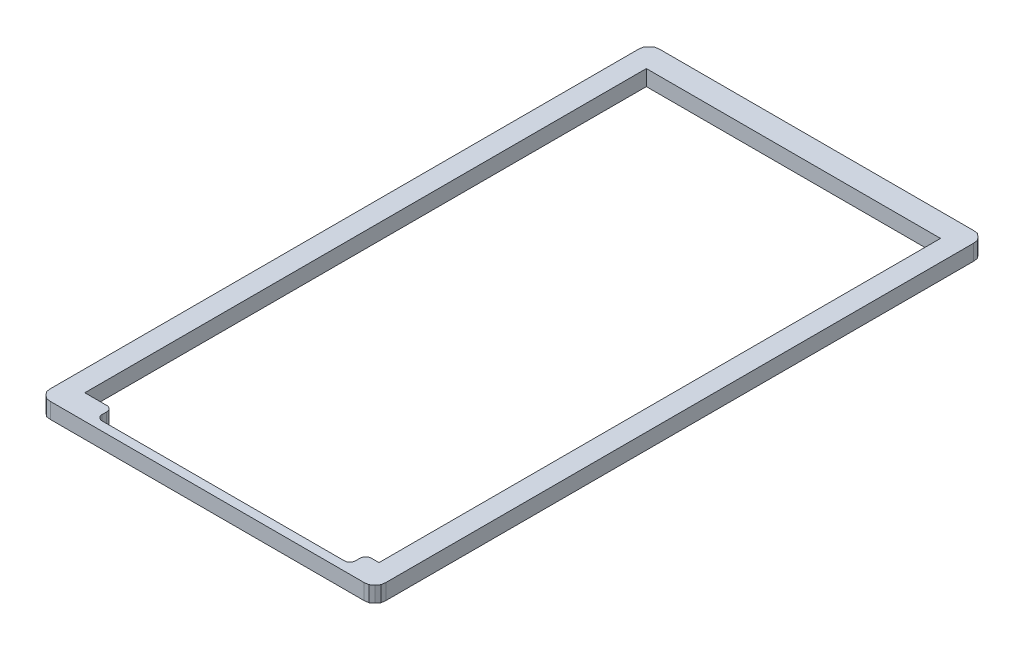
ISO-10303-21;
HEADER;
FILE_DESCRIPTION(('STEP AP214'),'2;1');
FILE_NAME('part.step','',(''),(''),'','','');
FILE_SCHEMA(('AUTOMOTIVE_DESIGN { 1 0 10303 214 1 1 1 1 }'));
ENDSEC;
DATA;
#1=APPLICATION_CONTEXT('core data for automotive mechanical design processes');
#2=APPLICATION_PROTOCOL_DEFINITION('international standard','automotive_design',2000,#1);
#3=PRODUCT_CONTEXT('',#1,'mechanical');
#4=PRODUCT('Part','Part','',(#3));
#5=PRODUCT_RELATED_PRODUCT_CATEGORY('part','',(#4));
#6=PRODUCT_DEFINITION_FORMATION('','',#4);
#7=PRODUCT_DEFINITION_CONTEXT('part definition',#1,'design');
#8=PRODUCT_DEFINITION('design','',#6,#7);
#9=PRODUCT_DEFINITION_SHAPE('','',#8);
#10=(LENGTH_UNIT() NAMED_UNIT(*) SI_UNIT(.MILLI.,.METRE.));
#11=(NAMED_UNIT(*) PLANE_ANGLE_UNIT() SI_UNIT($,.RADIAN.));
#12=(NAMED_UNIT(*) SI_UNIT($,.STERADIAN.) SOLID_ANGLE_UNIT());
#13=UNCERTAINTY_MEASURE_WITH_UNIT(LENGTH_MEASURE(1.E-05),#10,'distance_accuracy_value','');
#14=(GEOMETRIC_REPRESENTATION_CONTEXT(3) GLOBAL_UNCERTAINTY_ASSIGNED_CONTEXT((#13)) GLOBAL_UNIT_ASSIGNED_CONTEXT((#10,
#11,#12)) REPRESENTATION_CONTEXT('',''));
#15=CARTESIAN_POINT('',(0.,0.,0.));
#16=DIRECTION('',(0.,0.,1.));
#17=DIRECTION('',(1.,0.,0.));
#18=AXIS2_PLACEMENT_3D('',#15,#16,#17);
#19=CARTESIAN_POINT('',(14.4096306575184,63.9110415714486,-25.2102864699325));
#20=DIRECTION('',(-0.123874595080871,0.,0.992297881028449));
#21=DIRECTION('',(0.992297881028449,0.,0.123874595080871));
#22=AXIS2_PLACEMENT_3D('',#19,#20,#21);
#23=PLANE('',#22);
#24=DIRECTION('',(-0.992297881028449,0.,-0.123874595080871));
#25=VECTOR('',#24,1.);
#26=CARTESIAN_POINT('',(14.4096306575184,1.4,-25.2102864699325));
#27=LINE('',#26,#25);
#28=CARTESIAN_POINT('',(14.4096306575184,1.4,-25.2102864699325));
#29=VERTEX_POINT('',#28);
#30=CARTESIAN_POINT('',(14.016111453808,1.4,-25.2594118716371));
#31=VERTEX_POINT('',#30);
#32=EDGE_CURVE('E563',#29,#31,#27,.T.);
#33=ORIENTED_EDGE('',*,*,#32,.F.);
#34=DIRECTION('',(0.,-1.,0.));
#35=VECTOR('',#34,1.);
#36=CARTESIAN_POINT('',(14.4096306575184,63.9110415714486,-25.2102864699325));
#37=LINE('',#36,#35);
#38=CARTESIAN_POINT('',(14.4096306575184,0.,-25.2102864699325));
#39=VERTEX_POINT('',#38);
#40=EDGE_CURVE('E51',#29,#39,#37,.T.);
#41=ORIENTED_EDGE('',*,*,#40,.T.);
#42=DIRECTION('',(-0.992297881028449,0.,-0.123874595080871));
#43=VECTOR('',#42,1.);
#44=CARTESIAN_POINT('',(14.4096306575184,0.,-25.2102864699325));
#45=LINE('',#44,#43);
#46=CARTESIAN_POINT('',(14.016111453808,0.,-25.2594118716371));
#47=VERTEX_POINT('',#46);
#48=EDGE_CURVE('E342',#39,#47,#45,.T.);
#49=ORIENTED_EDGE('',*,*,#48,.T.);
#50=DIRECTION('',(0.,-1.,0.));
#51=VECTOR('',#50,1.);
#52=CARTESIAN_POINT('',(14.016111453808,63.9110415714486,-25.2594118716371));
#53=LINE('',#52,#51);
#54=EDGE_CURVE('E345',#31,#47,#53,.T.);
#55=ORIENTED_EDGE('',*,*,#54,.F.);
#56=EDGE_LOOP('',(#33,#41,#49,#55));
#57=FACE_BOUND('',#56,.T.);
#58=ADVANCED_FACE('F36',(#57),#23,.F.);
#59=CARTESIAN_POINT('',(14.7042744638658,63.9110415714486,-24.9645751018185));
#60=DIRECTION('',(-0.640453348110969,0.,0.76799707609694));
#61=DIRECTION('',(0.76799707609694,0.,0.64045334811097));
#62=AXIS2_PLACEMENT_3D('',#59,#60,#61);
#63=PLANE('',#62);
#64=DIRECTION('',(-0.76799707609694,0.,-0.64045334811097));
#65=VECTOR('',#64,1.);
#66=CARTESIAN_POINT('',(14.7042744638658,1.4,-24.9645751018185));
#67=LINE('',#66,#65);
#68=CARTESIAN_POINT('',(14.7042744638658,1.4,-24.9645751018185));
#69=VERTEX_POINT('',#68);
#70=EDGE_CURVE('E407',#69,#29,#67,.T.);
#71=ORIENTED_EDGE('',*,*,#70,.F.);
#72=DIRECTION('',(0.,-1.,0.));
#73=VECTOR('',#72,1.);
#74=CARTESIAN_POINT('',(14.7042744638658,63.9110415714486,-24.9645751018185));
#75=LINE('',#74,#73);
#76=CARTESIAN_POINT('',(14.7042744638658,0.,-24.9645751018185));
#77=VERTEX_POINT('',#76);
#78=EDGE_CURVE('E348',#69,#77,#75,.T.);
#79=ORIENTED_EDGE('',*,*,#78,.T.);
#80=DIRECTION('',(-0.76799707609694,0.,-0.64045334811097));
#81=VECTOR('',#80,1.);
#82=CARTESIAN_POINT('',(14.7042744638658,0.,-24.9645751018185));
#83=LINE('',#82,#81);
#84=EDGE_CURVE('E340',#77,#39,#83,.T.);
#85=ORIENTED_EDGE('',*,*,#84,.T.);
#86=ORIENTED_EDGE('',*,*,#40,.F.);
#87=EDGE_LOOP('',(#71,#79,#85,#86));
#88=FACE_BOUND('',#87,.T.);
#89=ADVANCED_FACE('F404',(#88),#63,.F.);
#90=CARTESIAN_POINT('',(14.950603089641,63.9110415714486,-24.6697164609948));
#91=DIRECTION('',(-0.767435927377188,0.,0.641125648660788));
#92=DIRECTION('',(0.641125648660788,0.,0.767435927377188));
#93=AXIS2_PLACEMENT_3D('',#90,#91,#92);
#94=PLANE('',#93);
#95=DIRECTION('',(-0.641125648660788,0.,-0.767435927377188));
#96=VECTOR('',#95,1.);
#97=CARTESIAN_POINT('',(14.950603089641,1.4,-24.6697164609948));
#98=LINE('',#97,#96);
#99=CARTESIAN_POINT('',(14.950603089641,1.4,-24.6697164609948));
#100=VERTEX_POINT('',#99);
#101=EDGE_CURVE('E412',#100,#69,#98,.T.);
#102=ORIENTED_EDGE('',*,*,#101,.F.);
#103=DIRECTION('',(0.,-1.,0.));
#104=VECTOR('',#103,1.);
#105=CARTESIAN_POINT('',(14.950603089641,63.9110415714486,-24.6697164609948));
#106=LINE('',#105,#104);
#107=CARTESIAN_POINT('',(14.950603089641,0.,-24.6697164609948));
#108=VERTEX_POINT('',#107);
#109=EDGE_CURVE('E350',#100,#108,#106,.T.);
#110=ORIENTED_EDGE('',*,*,#109,.T.);
#111=DIRECTION('',(-0.641125648660788,0.,-0.767435927377187));
#112=VECTOR('',#111,1.);
#113=CARTESIAN_POINT('',(14.950603089641,0.,-24.6697164609948));
#114=LINE('',#113,#112);
#115=EDGE_CURVE('E337',#108,#77,#114,.T.);
#116=ORIENTED_EDGE('',*,*,#115,.T.);
#117=ORIENTED_EDGE('',*,*,#78,.F.);
#118=EDGE_LOOP('',(#102,#110,#116,#117));
#119=FACE_BOUND('',#118,.T.);
#120=ADVANCED_FACE('F410',(#119),#94,.F.);
#121=CARTESIAN_POINT('',(14.9997812646371,63.9110415714486,-24.2766132656204));
#122=DIRECTION('',(-0.992265359293344,0.,0.124134832929561));
#123=DIRECTION('',(0.124134832929561,0.,0.992265359293344));
#124=AXIS2_PLACEMENT_3D('',#121,#122,#123);
#125=PLANE('',#124);
#126=DIRECTION('',(-0.124134832929561,0.,-0.992265359293344));
#127=VECTOR('',#126,1.);
#128=CARTESIAN_POINT('',(14.9997812646371,1.4,-24.2766132656204));
#129=LINE('',#128,#127);
#130=CARTESIAN_POINT('',(14.9997812646371,1.4,-24.2766132656204));
#131=VERTEX_POINT('',#130);
#132=EDGE_CURVE('E567',#131,#100,#129,.T.);
#133=ORIENTED_EDGE('',*,*,#132,.F.);
#134=DIRECTION('',(0.,-1.,0.));
#135=VECTOR('',#134,1.);
#136=CARTESIAN_POINT('',(14.9997812646371,63.9110415714486,-24.2766132656204));
#137=LINE('',#136,#135);
#138=CARTESIAN_POINT('',(14.9997812646371,0.,-24.2766132656204));
#139=VERTEX_POINT('',#138);
#140=EDGE_CURVE('E352',#131,#139,#137,.T.);
#141=ORIENTED_EDGE('',*,*,#140,.T.);
#142=DIRECTION('',(-0.124134832929561,0.,-0.992265359293344));
#143=VECTOR('',#142,1.);
#144=CARTESIAN_POINT('',(14.9997812646371,0.,-24.2766132656204));
#145=LINE('',#144,#143);
#146=EDGE_CURVE('E334',#139,#108,#145,.T.);
#147=ORIENTED_EDGE('',*,*,#146,.T.);
#148=ORIENTED_EDGE('',*,*,#109,.F.);
#149=EDGE_LOOP('',(#133,#141,#147,#148));
#150=FACE_BOUND('',#149,.T.);
#151=ADVANCED_FACE('F415',(#150),#125,.F.);
#152=CARTESIAN_POINT('',(14.9997124752265,63.9110415714486,28.2573158339782));
#153=DIRECTION('',(-0.999999999999143,0.,-1.30942824550507E-06));
#154=DIRECTION('',(-1.30942824550507E-06,0.,0.999999999999143));
#155=AXIS2_PLACEMENT_3D('',#152,#153,#154);
#156=PLANE('',#155);
#157=DIRECTION('',(1.30942824550507E-06,0.,-0.999999999999143));
#158=VECTOR('',#157,1.);
#159=CARTESIAN_POINT('',(14.9997124752265,1.4,28.2573158339782));
#160=LINE('',#159,#158);
#161=CARTESIAN_POINT('',(14.9997124752265,1.4,28.2573158339782));
#162=VERTEX_POINT('',#161);
#163=EDGE_CURVE('E424',#162,#131,#160,.T.);
#164=ORIENTED_EDGE('',*,*,#163,.F.);
#165=DIRECTION('',(0.,-1.,0.));
#166=VECTOR('',#165,1.);
#167=CARTESIAN_POINT('',(14.9997124752265,63.9110415714486,28.2573158339782));
#168=LINE('',#167,#166);
#169=CARTESIAN_POINT('',(14.9997124752265,0.,28.2573158339782));
#170=VERTEX_POINT('',#169);
#171=EDGE_CURVE('E354',#162,#170,#168,.T.);
#172=ORIENTED_EDGE('',*,*,#171,.T.);
#173=DIRECTION('',(1.30942824550507E-06,0.,-0.999999999999143));
#174=VECTOR('',#173,1.);
#175=CARTESIAN_POINT('',(14.9997124752265,0.,28.2573158339782));
#176=LINE('',#175,#174);
#177=EDGE_CURVE('E331',#170,#139,#176,.T.);
#178=ORIENTED_EDGE('',*,*,#177,.T.);
#179=ORIENTED_EDGE('',*,*,#140,.F.);
#180=EDGE_LOOP('',(#164,#172,#178,#179));
#181=FACE_BOUND('',#180,.T.);
#182=ADVANCED_FACE('F421',(#181),#156,.F.);
#183=CARTESIAN_POINT('',(14.9504655108198,63.9110415714486,28.6505377576656));
#184=DIRECTION('',(-0.992248585974181,0.,-0.124268836126516));
#185=DIRECTION('',(-0.124268836126516,0.,0.992248585974181));
#186=AXIS2_PLACEMENT_3D('',#183,#184,#185);
#187=PLANE('',#186);
#188=DIRECTION('',(0.124268836126516,0.,-0.992248585974181));
#189=VECTOR('',#188,1.);
#190=CARTESIAN_POINT('',(14.9504655108198,1.4,28.6505377576656));
#191=LINE('',#190,#189);
#192=CARTESIAN_POINT('',(14.9504655108198,1.4,28.6505377576656));
#193=VERTEX_POINT('',#192);
#194=EDGE_CURVE('E429',#193,#162,#191,.T.);
#195=ORIENTED_EDGE('',*,*,#194,.F.);
#196=DIRECTION('',(0.,-1.,0.));
#197=VECTOR('',#196,1.);
#198=CARTESIAN_POINT('',(14.9504655108198,63.9110415714486,28.6505377576656));
#199=LINE('',#198,#197);
#200=CARTESIAN_POINT('',(14.9504655108198,0.,28.6505377576656));
#201=VERTEX_POINT('',#200);
#202=EDGE_CURVE('E356',#193,#201,#199,.T.);
#203=ORIENTED_EDGE('',*,*,#202,.T.);
#204=DIRECTION('',(0.124268836126516,0.,-0.992248585974181));
#205=VECTOR('',#204,1.);
#206=CARTESIAN_POINT('',(14.9504655108198,0.,28.6505377576656));
#207=LINE('',#206,#205);
#208=EDGE_CURVE('E328',#201,#170,#207,.T.);
#209=ORIENTED_EDGE('',*,*,#208,.T.);
#210=ORIENTED_EDGE('',*,*,#171,.F.);
#211=EDGE_LOOP('',(#195,#203,#209,#210));
#212=FACE_BOUND('',#211,.T.);
#213=ADVANCED_FACE('F427',(#212),#187,.F.);
#214=CARTESIAN_POINT('',(14.7045621286737,63.9110415714486,28.9453963984893));
#215=DIRECTION('',(-0.767980603694604,0.,-0.640473100410057));
#216=DIRECTION('',(-0.640473100410057,0.,0.767980603694604));
#217=AXIS2_PLACEMENT_3D('',#214,#215,#216);
#218=PLANE('',#217);
#219=DIRECTION('',(0.640473100410057,0.,-0.767980603694604));
#220=VECTOR('',#219,1.);
#221=CARTESIAN_POINT('',(14.7045621286737,1.4,28.9453963984893));
#222=LINE('',#221,#220);
#223=CARTESIAN_POINT('',(14.7045621286737,1.4,28.9453963984893));
#224=VERTEX_POINT('',#223);
#225=EDGE_CURVE('E571',#224,#193,#222,.T.);
#226=ORIENTED_EDGE('',*,*,#225,.F.);
#227=DIRECTION('',(0.,-1.,0.));
#228=VECTOR('',#227,1.);
#229=CARTESIAN_POINT('',(14.7045621286737,63.9110415714486,28.9453963984893));
#230=LINE('',#229,#228);
#231=CARTESIAN_POINT('',(14.7045621286737,0.,28.9453963984893));
#232=VERTEX_POINT('',#231);
#233=EDGE_CURVE('E358',#224,#232,#230,.T.);
#234=ORIENTED_EDGE('',*,*,#233,.T.);
#235=DIRECTION('',(0.640473100410057,0.,-0.767980603694604));
#236=VECTOR('',#235,1.);
#237=CARTESIAN_POINT('',(14.7045621286737,0.,28.9453963984893));
#238=LINE('',#237,#236);
#239=EDGE_CURVE('E325',#232,#201,#238,.T.);
#240=ORIENTED_EDGE('',*,*,#239,.T.);
#241=ORIENTED_EDGE('',*,*,#202,.F.);
#242=EDGE_LOOP('',(#226,#234,#240,#241));
#243=FACE_BOUND('',#242,.T.);
#244=ADVANCED_FACE('F432',(#243),#218,.F.);
#245=CARTESIAN_POINT('',(14.4094805715316,63.9110415714486,29.1911140154618));
#246=DIRECTION('',(-0.639902054883014,0.,-0.768456479025648));
#247=DIRECTION('',(-0.768456479025648,0.,0.639902054883014));
#248=AXIS2_PLACEMENT_3D('',#245,#246,#247);
#249=PLANE('',#248);
#250=DIRECTION('',(0.768456479025648,0.,-0.639902054883014));
#251=VECTOR('',#250,1.);
#252=CARTESIAN_POINT('',(14.4094805715316,1.4,29.1911140154618));
#253=LINE('',#252,#251);
#254=CARTESIAN_POINT('',(14.4094805715316,1.4,29.1911140154618));
#255=VERTEX_POINT('',#254);
#256=EDGE_CURVE('E441',#255,#224,#253,.T.);
#257=ORIENTED_EDGE('',*,*,#256,.F.);
#258=DIRECTION('',(0.,-1.,0.));
#259=VECTOR('',#258,1.);
#260=CARTESIAN_POINT('',(14.4094805715316,63.9110415714486,29.1911140154618));
#261=LINE('',#260,#259);
#262=CARTESIAN_POINT('',(14.4094805715316,0.,29.1911140154618));
#263=VERTEX_POINT('',#262);
#264=EDGE_CURVE('E360',#255,#263,#261,.T.);
#265=ORIENTED_EDGE('',*,*,#264,.T.);
#266=DIRECTION('',(0.768456479025648,0.,-0.639902054883014));
#267=VECTOR('',#266,1.);
#268=CARTESIAN_POINT('',(14.4094805715316,0.,29.1911140154618));
#269=LINE('',#268,#267);
#270=EDGE_CURVE('E322',#263,#232,#269,.T.);
#271=ORIENTED_EDGE('',*,*,#270,.T.);
#272=ORIENTED_EDGE('',*,*,#233,.F.);
#273=EDGE_LOOP('',(#257,#265,#271,#272));
#274=FACE_BOUND('',#273,.T.);
#275=ADVANCED_FACE('F438',(#274),#249,.F.);
#276=CARTESIAN_POINT('',(14.0159426070729,63.9110415714486,29.2402550393129));
#277=DIRECTION('',(-0.123907566611649,0.,-0.992293764434897));
#278=DIRECTION('',(-0.992293764434897,0.,0.123907566611649));
#279=AXIS2_PLACEMENT_3D('',#276,#277,#278);
#280=PLANE('',#279);
#281=DIRECTION('',(0.992293764434897,0.,-0.123907566611649));
#282=VECTOR('',#281,1.);
#283=CARTESIAN_POINT('',(14.0159426070729,1.4,29.2402550393129));
#284=LINE('',#283,#282);
#285=CARTESIAN_POINT('',(14.0159426070729,1.4,29.2402550393129));
#286=VERTEX_POINT('',#285);
#287=EDGE_CURVE('E446',#286,#255,#284,.T.);
#288=ORIENTED_EDGE('',*,*,#287,.F.);
#289=DIRECTION('',(0.,-1.,0.));
#290=VECTOR('',#289,1.);
#291=CARTESIAN_POINT('',(14.0159426070729,63.9110415714486,29.2402550393129));
#292=LINE('',#291,#290);
#293=CARTESIAN_POINT('',(14.0159426070729,0.,29.2402550393129));
#294=VERTEX_POINT('',#293);
#295=EDGE_CURVE('E362',#286,#294,#292,.T.);
#296=ORIENTED_EDGE('',*,*,#295,.T.);
#297=DIRECTION('',(0.992293764434897,0.,-0.123907566611649));
#298=VECTOR('',#297,1.);
#299=CARTESIAN_POINT('',(14.0159426070729,0.,29.2402550393129));
#300=LINE('',#299,#298);
#301=EDGE_CURVE('E319',#294,#263,#300,.T.);
#302=ORIENTED_EDGE('',*,*,#301,.T.);
#303=ORIENTED_EDGE('',*,*,#264,.F.);
#304=EDGE_LOOP('',(#288,#296,#302,#303));
#305=FACE_BOUND('',#304,.T.);
#306=ADVANCED_FACE('F444',(#305),#280,.F.);
#307=CARTESIAN_POINT('',(-14.0169491538318,63.9110415714486,29.2401738041514));
#308=DIRECTION('',(2.8978516447548E-06,0.,-0.999999999995801));
#309=DIRECTION('',(-0.999999999995801,0.,-2.8978516447548E-06));
#310=AXIS2_PLACEMENT_3D('',#307,#308,#309);
#311=PLANE('',#310);
#312=DIRECTION('',(0.999999999995801,0.,2.8978516447548E-06));
#313=VECTOR('',#312,1.);
#314=CARTESIAN_POINT('',(-14.0169491538318,1.4,29.2401738041514));
#315=LINE('',#314,#313);
#316=CARTESIAN_POINT('',(-14.0169491538318,1.4,29.2401738041514));
#317=VERTEX_POINT('',#316);
#318=EDGE_CURVE('E575',#317,#286,#315,.T.);
#319=ORIENTED_EDGE('',*,*,#318,.F.);
#320=DIRECTION('',(0.,-1.,0.));
#321=VECTOR('',#320,1.);
#322=CARTESIAN_POINT('',(-14.0169491538318,63.9110415714486,29.2401738041514));
#323=LINE('',#322,#321);
#324=CARTESIAN_POINT('',(-14.0169491538318,0.,29.2401738041514));
#325=VERTEX_POINT('',#324);
#326=EDGE_CURVE('E364',#317,#325,#323,.T.);
#327=ORIENTED_EDGE('',*,*,#326,.T.);
#328=DIRECTION('',(0.999999999995801,0.,2.8978516447548E-06));
#329=VECTOR('',#328,1.);
#330=CARTESIAN_POINT('',(-14.0169491538318,0.,29.2401738041514));
#331=LINE('',#330,#329);
#332=EDGE_CURVE('E316',#325,#294,#331,.T.);
#333=ORIENTED_EDGE('',*,*,#332,.T.);
#334=ORIENTED_EDGE('',*,*,#295,.F.);
#335=EDGE_LOOP('',(#319,#327,#333,#334));
#336=FACE_BOUND('',#335,.T.);
#337=ADVANCED_FACE('F449',(#336),#311,.F.);
#338=CARTESIAN_POINT('',(-14.4100556210787,63.9110415714486,29.1909515451389));
#339=DIRECTION('',(0.124243374046642,0.,-0.992251774503581));
#340=DIRECTION('',(-0.992251774503581,0.,-0.124243374046642));
#341=AXIS2_PLACEMENT_3D('',#338,#339,#340);
#342=PLANE('',#341);
#343=DIRECTION('',(0.992251774503581,0.,0.124243374046642));
#344=VECTOR('',#343,1.);
#345=CARTESIAN_POINT('',(-14.4100556210787,1.4,29.1909515451389));
#346=LINE('',#345,#344);
#347=CARTESIAN_POINT('',(-14.4100556210787,1.4,29.1909515451389));
#348=VERTEX_POINT('',#347);
#349=EDGE_CURVE('E458',#348,#317,#346,.T.);
#350=ORIENTED_EDGE('',*,*,#349,.F.);
#351=DIRECTION('',(0.,-1.,0.));
#352=VECTOR('',#351,1.);
#353=CARTESIAN_POINT('',(-14.4100556210787,63.9110415714486,29.1909515451389));
#354=LINE('',#353,#352);
#355=CARTESIAN_POINT('',(-14.4100556210787,0.,29.1909515451389));
#356=VERTEX_POINT('',#355);
#357=EDGE_CURVE('E366',#348,#356,#354,.T.);
#358=ORIENTED_EDGE('',*,*,#357,.T.);
#359=DIRECTION('',(0.992251774503581,0.,0.124243374046642));
#360=VECTOR('',#359,1.);
#361=CARTESIAN_POINT('',(-14.4100556210787,0.,29.1909515451389));
#362=LINE('',#361,#360);
#363=EDGE_CURVE('E313',#356,#325,#362,.T.);
#364=ORIENTED_EDGE('',*,*,#363,.T.);
#365=ORIENTED_EDGE('',*,*,#326,.F.);
#366=EDGE_LOOP('',(#350,#358,#364,#365));
#367=FACE_BOUND('',#366,.T.);
#368=ADVANCED_FACE('F455',(#367),#342,.F.);
#369=CARTESIAN_POINT('',(-14.7051371782208,63.9110415714486,28.9456463528323));
#370=DIRECTION('',(0.639267150755278,0.,-0.768984726743795));
#371=DIRECTION('',(-0.768984726743795,0.,-0.639267150755278));
#372=AXIS2_PLACEMENT_3D('',#369,#370,#371);
#373=PLANE('',#372);
#374=DIRECTION('',(0.768984726743795,0.,0.639267150755278));
#375=VECTOR('',#374,1.);
#376=CARTESIAN_POINT('',(-14.7051371782208,1.4,28.9456463528323));
#377=LINE('',#376,#375);
#378=CARTESIAN_POINT('',(-14.7051371782208,1.4,28.9456463528323));
#379=VERTEX_POINT('',#378);
#380=EDGE_CURVE('E463',#379,#348,#377,.T.);
#381=ORIENTED_EDGE('',*,*,#380,.F.);
#382=DIRECTION('',(0.,-1.,0.));
#383=VECTOR('',#382,1.);
#384=CARTESIAN_POINT('',(-14.7051371782208,63.9110415714486,28.9456463528323));
#385=LINE('',#384,#383);
#386=CARTESIAN_POINT('',(-14.7051371782208,0.,28.9456463528323));
#387=VERTEX_POINT('',#386);
#388=EDGE_CURVE('E368',#379,#387,#385,.T.);
#389=ORIENTED_EDGE('',*,*,#388,.T.);
#390=DIRECTION('',(0.768984726743795,0.,0.639267150755278));
#391=VECTOR('',#390,1.);
#392=CARTESIAN_POINT('',(-14.7051371782208,0.,28.9456463528323));
#393=LINE('',#392,#391);
#394=EDGE_CURVE('E310',#387,#356,#393,.T.);
#395=ORIENTED_EDGE('',*,*,#394,.T.);
#396=ORIENTED_EDGE('',*,*,#357,.F.);
#397=EDGE_LOOP('',(#381,#389,#395,#396));
#398=FACE_BOUND('',#397,.T.);
#399=ADVANCED_FACE('F461',(#398),#373,.F.);
#400=CARTESIAN_POINT('',(-14.9510405603669,63.9110415714486,28.6503752873426));
#401=DIRECTION('',(0.768420697805103,0.,-0.63994502200167));
#402=DIRECTION('',(-0.63994502200167,0.,-0.768420697805103));
#403=AXIS2_PLACEMENT_3D('',#400,#401,#402);
#404=PLANE('',#403);
#405=DIRECTION('',(0.63994502200167,0.,0.768420697805103));
#406=VECTOR('',#405,1.);
#407=CARTESIAN_POINT('',(-14.9510405603669,1.4,28.6503752873426));
#408=LINE('',#407,#406);
#409=CARTESIAN_POINT('',(-14.9510405603669,1.4,28.6503752873426));
#410=VERTEX_POINT('',#409);
#411=EDGE_CURVE('E579',#410,#379,#408,.T.);
#412=ORIENTED_EDGE('',*,*,#411,.F.);
#413=DIRECTION('',(0.,-1.,0.));
#414=VECTOR('',#413,1.);
#415=CARTESIAN_POINT('',(-14.9510405603669,63.9110415714486,28.6503752873426));
#416=LINE('',#415,#414);
#417=CARTESIAN_POINT('',(-14.9510405603669,0.,28.6503752873426));
#418=VERTEX_POINT('',#417);
#419=EDGE_CURVE('E370',#410,#418,#416,.T.);
#420=ORIENTED_EDGE('',*,*,#419,.T.);
#421=DIRECTION('',(0.63994502200167,0.,0.768420697805103));
#422=VECTOR('',#421,1.);
#423=CARTESIAN_POINT('',(-14.9510405603669,0.,28.6503752873426));
#424=LINE('',#423,#422);
#425=EDGE_CURVE('E307',#418,#387,#424,.T.);
#426=ORIENTED_EDGE('',*,*,#425,.T.);
#427=ORIENTED_EDGE('',*,*,#388,.F.);
#428=EDGE_LOOP('',(#412,#420,#426,#427));
#429=FACE_BOUND('',#428,.T.);
#430=ADVANCED_FACE('F466',(#429),#404,.F.);
#431=CARTESIAN_POINT('',(-15.0002187353629,63.9110415714486,28.2572783408268));
#432=DIRECTION('',(0.992265116230005,0.,-0.124136775828339));
#433=DIRECTION('',(-0.124136775828339,0.,-0.992265116230005));
#434=AXIS2_PLACEMENT_3D('',#431,#432,#433);
#435=PLANE('',#434);
#436=DIRECTION('',(0.124136775828339,0.,0.992265116230005));
#437=VECTOR('',#436,1.);
#438=CARTESIAN_POINT('',(-15.0002187353629,1.4,28.2572783408268));
#439=LINE('',#438,#437);
#440=CARTESIAN_POINT('',(-15.0002187353629,1.4,28.2572783408268));
#441=VERTEX_POINT('',#440);
#442=EDGE_CURVE('E475',#441,#410,#439,.T.);
#443=ORIENTED_EDGE('',*,*,#442,.F.);
#444=DIRECTION('',(0.,-1.,0.));
#445=VECTOR('',#444,1.);
#446=CARTESIAN_POINT('',(-15.0002187353629,63.9110415714486,28.2572783408268));
#447=LINE('',#446,#445);
#448=CARTESIAN_POINT('',(-15.0002187353629,0.,28.2572783408268));
#449=VERTEX_POINT('',#448);
#450=EDGE_CURVE('E372',#441,#449,#447,.T.);
#451=ORIENTED_EDGE('',*,*,#450,.T.);
#452=DIRECTION('',(0.124136775828339,0.,0.992265116230005));
#453=VECTOR('',#452,1.);
#454=CARTESIAN_POINT('',(-15.0002187353629,0.,28.2572783408268));
#455=LINE('',#454,#453);
#456=EDGE_CURVE('E304',#449,#418,#455,.T.);
#457=ORIENTED_EDGE('',*,*,#456,.T.);
#458=ORIENTED_EDGE('',*,*,#419,.F.);
#459=EDGE_LOOP('',(#443,#451,#457,#458));
#460=FACE_BOUND('',#459,.T.);
#461=ADVANCED_FACE('F472',(#460),#435,.F.);
#462=CARTESIAN_POINT('',(-15.0001186780384,63.9110415714486,-24.2765476526053));
#463=DIRECTION('',(0.999999999998186,0.,1.90462664059276E-06));
#464=DIRECTION('',(1.90462664059276E-06,0.,-0.999999999998186));
#465=AXIS2_PLACEMENT_3D('',#462,#463,#464);
#466=PLANE('',#465);
#467=DIRECTION('',(-1.90462664059276E-06,0.,0.999999999998186));
#468=VECTOR('',#467,1.);
#469=CARTESIAN_POINT('',(-15.0001186780384,1.4,-24.2765476526053));
#470=LINE('',#469,#468);
#471=CARTESIAN_POINT('',(-15.0001186780384,1.4,-24.2765476526053));
#472=VERTEX_POINT('',#471);
#473=EDGE_CURVE('E480',#472,#441,#470,.T.);
#474=ORIENTED_EDGE('',*,*,#473,.F.);
#475=DIRECTION('',(0.,-1.,0.));
#476=VECTOR('',#475,1.);
#477=CARTESIAN_POINT('',(-15.0001186780384,63.9110415714486,-24.2765476526053));
#478=LINE('',#477,#476);
#479=CARTESIAN_POINT('',(-15.0001186780384,0.,-24.2765476526053));
#480=VERTEX_POINT('',#479);
#481=EDGE_CURVE('E374',#472,#480,#478,.T.);
#482=ORIENTED_EDGE('',*,*,#481,.T.);
#483=DIRECTION('',(-1.90462664059276E-06,0.,0.999999999998186));
#484=VECTOR('',#483,1.);
#485=CARTESIAN_POINT('',(-15.0001186780384,0.,-24.2765476526053));
#486=LINE('',#485,#484);
#487=EDGE_CURVE('E301',#480,#449,#486,.T.);
#488=ORIENTED_EDGE('',*,*,#487,.T.);
#489=ORIENTED_EDGE('',*,*,#450,.F.);
#490=EDGE_LOOP('',(#474,#482,#488,#489));
#491=FACE_BOUND('',#490,.T.);
#492=ADVANCED_FACE('F478',(#491),#466,.F.);
#493=CARTESIAN_POINT('',(-14.9508404457178,63.9110415714486,-24.6696727189848));
#494=DIRECTION('',(0.992235073728112,0.,0.124376679742502));
#495=DIRECTION('',(0.124376679742502,0.,-0.992235073728112));
#496=AXIS2_PLACEMENT_3D('',#493,#494,#495);
#497=PLANE('',#496);
#498=DIRECTION('',(-0.124376679742502,0.,0.992235073728112));
#499=VECTOR('',#498,1.);
#500=CARTESIAN_POINT('',(-14.9508404457178,1.4,-24.6696727189848));
#501=LINE('',#500,#499);
#502=CARTESIAN_POINT('',(-14.9508404457178,1.4,-24.6696727189848));
#503=VERTEX_POINT('',#502);
#504=EDGE_CURVE('E583',#503,#472,#501,.T.);
#505=ORIENTED_EDGE('',*,*,#504,.F.);
#506=DIRECTION('',(0.,-1.,0.));
#507=VECTOR('',#506,1.);
#508=CARTESIAN_POINT('',(-14.9508404457178,63.9110415714486,-24.6696727189848));
#509=LINE('',#508,#507);
#510=CARTESIAN_POINT('',(-14.9508404457178,0.,-24.6696727189848));
#511=VERTEX_POINT('',#510);
#512=EDGE_CURVE('E376',#503,#511,#509,.T.);
#513=ORIENTED_EDGE('',*,*,#512,.T.);
#514=DIRECTION('',(-0.124376679742502,0.,0.992235073728112));
#515=VECTOR('',#514,1.);
#516=CARTESIAN_POINT('',(-14.9508404457178,0.,-24.6696727189848));
#517=LINE('',#516,#515);
#518=EDGE_CURVE('E298',#511,#480,#517,.T.);
#519=ORIENTED_EDGE('',*,*,#518,.T.);
#520=ORIENTED_EDGE('',*,*,#481,.F.);
#521=EDGE_LOOP('',(#505,#513,#519,#520));
#522=FACE_BOUND('',#521,.T.);
#523=ADVANCED_FACE('F483',(#522),#497,.F.);
#524=CARTESIAN_POINT('',(-14.7053748143665,63.9110415714486,-24.9645313598085));
#525=DIRECTION('',(0.76854152682786,0.,0.63979990742505));
#526=DIRECTION('',(0.63979990742505,0.,-0.76854152682786));
#527=AXIS2_PLACEMENT_3D('',#524,#525,#526);
#528=PLANE('',#527);
#529=DIRECTION('',(-0.63979990742505,0.,0.76854152682786));
#530=VECTOR('',#529,1.);
#531=CARTESIAN_POINT('',(-14.7053748143665,1.4,-24.9645313598085));
#532=LINE('',#531,#530);
#533=CARTESIAN_POINT('',(-14.7053748143665,1.4,-24.9645313598085));
#534=VERTEX_POINT('',#533);
#535=EDGE_CURVE('E489',#534,#503,#532,.T.);
#536=ORIENTED_EDGE('',*,*,#535,.F.);
#537=DIRECTION('',(0.,-1.,0.));
#538=VECTOR('',#537,1.);
#539=CARTESIAN_POINT('',(-14.7053748143665,63.9110415714486,-24.9645313598085));
#540=LINE('',#539,#538);
#541=CARTESIAN_POINT('',(-14.7053748143665,0.,-24.9645313598085));
#542=VERTEX_POINT('',#541);
#543=EDGE_CURVE('E378',#534,#542,#540,.T.);
#544=ORIENTED_EDGE('',*,*,#543,.T.);
#545=DIRECTION('',(-0.63979990742505,0.,0.76854152682786));
#546=VECTOR('',#545,1.);
#547=CARTESIAN_POINT('',(-14.7053748143665,0.,-24.9645313598085));
#548=LINE('',#547,#546);
#549=EDGE_CURVE('E295',#542,#511,#548,.T.);
#550=ORIENTED_EDGE('',*,*,#549,.T.);
#551=ORIENTED_EDGE('',*,*,#512,.F.);
#552=EDGE_LOOP('',(#536,#544,#550,#551));
#553=FACE_BOUND('',#552,.T.);
#554=ADVANCED_FACE('F486',(#553),#528,.F.);
#555=CARTESIAN_POINT('',(-14.4098555064297,63.9110415714486,-25.210248976781));
#556=DIRECTION('',(0.639341796584541,0.,0.768922666553699));
#557=DIRECTION('',(0.768922666553699,0.,-0.639341796584541));
#558=AXIS2_PLACEMENT_3D('',#555,#556,#557);
#559=PLANE('',#558);
#560=DIRECTION('',(-0.768922666553699,0.,0.639341796584541));
#561=VECTOR('',#560,1.);
#562=CARTESIAN_POINT('',(-14.4098555064297,1.4,-25.210248976781));
#563=LINE('',#562,#561);
#564=CARTESIAN_POINT('',(-14.4098555064297,1.4,-25.210248976781));
#565=VERTEX_POINT('',#564);
#566=EDGE_CURVE('E493',#565,#534,#563,.T.);
#567=ORIENTED_EDGE('',*,*,#566,.F.);
#568=DIRECTION('',(0.,-1.,0.));
#569=VECTOR('',#568,1.);
#570=CARTESIAN_POINT('',(-14.4098555064297,63.9110415714486,-25.210248976781));
#571=LINE('',#570,#569);
#572=CARTESIAN_POINT('',(-14.4098555064297,0.,-25.210248976781));
#573=VERTEX_POINT('',#572);
#574=EDGE_CURVE('E380',#565,#573,#571,.T.);
#575=ORIENTED_EDGE('',*,*,#574,.T.);
#576=DIRECTION('',(-0.768922666553699,0.,0.639341796584541));
#577=VECTOR('',#576,1.);
#578=CARTESIAN_POINT('',(-14.4098555064297,0.,-25.210248976781));
#579=LINE('',#578,#577);
#580=EDGE_CURVE('E292',#573,#542,#579,.T.);
#581=ORIENTED_EDGE('',*,*,#580,.T.);
#582=ORIENTED_EDGE('',*,*,#543,.F.);
#583=EDGE_LOOP('',(#567,#575,#581,#582));
#584=FACE_BOUND('',#583,.T.);
#585=ADVANCED_FACE('F492',(#584),#559,.F.);
#586=CARTESIAN_POINT('',(-14.0167552927656,63.9110415714486,-25.2593900006321));
#587=DIRECTION('',(0.124043426381393,0.,0.992276790200982));
#588=DIRECTION('',(0.992276790200982,0.,-0.124043426381393));
#589=AXIS2_PLACEMENT_3D('',#586,#587,#588);
#590=PLANE('',#589);
#591=DIRECTION('',(-0.992276790200982,0.,0.124043426381393));
#592=VECTOR('',#591,1.);
#593=CARTESIAN_POINT('',(-14.0167552927656,1.4,-25.2593900006321));
#594=LINE('',#593,#592);
#595=CARTESIAN_POINT('',(-14.0167552927656,1.4,-25.2593900006321));
#596=VERTEX_POINT('',#595);
#597=EDGE_CURVE('E388',#596,#565,#594,.T.);
#598=ORIENTED_EDGE('',*,*,#597,.F.);
#599=DIRECTION('',(0.,-1.,0.));
#600=VECTOR('',#599,1.);
#601=CARTESIAN_POINT('',(-14.0167552927656,63.9110415714486,-25.2593900006321));
#602=LINE('',#601,#600);
#603=CARTESIAN_POINT('',(-14.0167552927656,0.,-25.2593900006321));
#604=VERTEX_POINT('',#603);
#605=EDGE_CURVE('E44',#596,#604,#602,.T.);
#606=ORIENTED_EDGE('',*,*,#605,.T.);
#607=DIRECTION('',(-0.992276790200982,0.,0.124043426381393));
#608=VECTOR('',#607,1.);
#609=CARTESIAN_POINT('',(-14.0167552927656,0.,-25.2593900006321));
#610=LINE('',#609,#608);
#611=EDGE_CURVE('E289',#604,#573,#610,.T.);
#612=ORIENTED_EDGE('',*,*,#611,.T.);
#613=ORIENTED_EDGE('',*,*,#574,.F.);
#614=EDGE_LOOP('',(#598,#606,#612,#613));
#615=FACE_BOUND('',#614,.T.);
#616=ADVANCED_FACE('F384',(#615),#590,.F.);
#617=CARTESIAN_POINT('',(14.016111453808,63.9110415714486,-25.2594118716371));
#618=DIRECTION('',(7.80191523584791E-07,0.,0.999999999999696));
#619=DIRECTION('',(0.999999999999696,0.,-7.80191523584791E-07));
#620=AXIS2_PLACEMENT_3D('',#617,#618,#619);
#621=PLANE('',#620);
#622=DIRECTION('',(-0.999999999999696,0.,7.80191523584791E-07));
#623=VECTOR('',#622,1.);
#624=CARTESIAN_POINT('',(14.016111453808,1.4,-25.2594118716371));
#625=LINE('',#624,#623);
#626=EDGE_CURVE('E398',#31,#596,#625,.T.);
#627=ORIENTED_EDGE('',*,*,#626,.F.);
#628=ORIENTED_EDGE('',*,*,#54,.T.);
#629=DIRECTION('',(-0.999999999999696,0.,7.80191523584791E-07));
#630=VECTOR('',#629,1.);
#631=CARTESIAN_POINT('',(14.016111453808,0.,-25.2594118716371));
#632=LINE('',#631,#630);
#633=EDGE_CURVE('E286',#47,#604,#632,.T.);
#634=ORIENTED_EDGE('',*,*,#633,.T.);
#635=ORIENTED_EDGE('',*,*,#605,.F.);
#636=EDGE_LOOP('',(#627,#628,#634,#635));
#637=FACE_BOUND('',#636,.T.);
#638=ADVANCED_FACE('F38',(#637),#621,.F.);
#639=CARTESIAN_POINT('',(0.,0.,0.));
#640=DIRECTION('',(0.,-1.,0.));
#641=DIRECTION('',(0.,0.,-1.));
#642=AXIS2_PLACEMENT_3D('',#639,#640,#641);
#643=PLANE('',#642);
#644=ORIENTED_EDGE('',*,*,#633,.F.);
#645=ORIENTED_EDGE('',*,*,#48,.F.);
#646=ORIENTED_EDGE('',*,*,#84,.F.);
#647=ORIENTED_EDGE('',*,*,#115,.F.);
#648=ORIENTED_EDGE('',*,*,#146,.F.);
#649=ORIENTED_EDGE('',*,*,#177,.F.);
#650=ORIENTED_EDGE('',*,*,#208,.F.);
#651=ORIENTED_EDGE('',*,*,#239,.F.);
#652=ORIENTED_EDGE('',*,*,#270,.F.);
#653=ORIENTED_EDGE('',*,*,#301,.F.);
#654=ORIENTED_EDGE('',*,*,#332,.F.);
#655=ORIENTED_EDGE('',*,*,#363,.F.);
#656=ORIENTED_EDGE('',*,*,#394,.F.);
#657=ORIENTED_EDGE('',*,*,#425,.F.);
#658=ORIENTED_EDGE('',*,*,#456,.F.);
#659=ORIENTED_EDGE('',*,*,#487,.F.);
#660=ORIENTED_EDGE('',*,*,#518,.F.);
#661=ORIENTED_EDGE('',*,*,#549,.F.);
#662=ORIENTED_EDGE('',*,*,#580,.F.);
#663=ORIENTED_EDGE('',*,*,#611,.F.);
#664=EDGE_LOOP('',(#644,#645,#646,#647,#648,#649,#650,#651,#652,#653,#654,#655,#656,#657,#658,
#659,#660,#661,#662,#663));
#665=FACE_BOUND('',#664,.T.);
#666=DIRECTION('',(1.,0.,0.));
#667=VECTOR('',#666,1.);
#668=CARTESIAN_POINT('',(-13.15,0.,27.0306099993679));
#669=LINE('',#668,#667);
#670=CARTESIAN_POINT('',(-13.15,0.,27.0306099993679));
#671=VERTEX_POINT('',#670);
#672=CARTESIAN_POINT('',(-11.1936715428225,0.,27.0306099993679));
#673=VERTEX_POINT('',#672);
#674=EDGE_CURVE('E260',#671,#673,#669,.T.);
#675=ORIENTED_EDGE('',*,*,#674,.T.);
#676=CARTESIAN_POINT('',(-11.1936715428225,0.,27.5306099993679));
#677=DIRECTION('',(0.,-1.,0.));
#678=DIRECTION('',(0.,0.,-1.));
#679=AXIS2_PLACEMENT_3D('',#676,#677,#678);
#680=CIRCLE('',#679,0.5);
#681=CARTESIAN_POINT('',(-10.6936715428225,0.,27.5306099993679));
#682=VERTEX_POINT('',#681);
#683=EDGE_CURVE('E495',#673,#682,#680,.T.);
#684=ORIENTED_EDGE('',*,*,#683,.T.);
#685=DIRECTION('',(0.,0.,1.));
#686=VECTOR('',#685,1.);
#687=CARTESIAN_POINT('',(-10.6936715428225,0.,27.5306099993679));
#688=LINE('',#687,#686);
#689=CARTESIAN_POINT('',(-10.6936715428225,0.,27.9402550393129));
#690=VERTEX_POINT('',#689);
#691=EDGE_CURVE('E502',#682,#690,#688,.T.);
#692=ORIENTED_EDGE('',*,*,#691,.T.);
#693=CARTESIAN_POINT('',(-10.1936715428225,0.,27.9402550393129));
#694=DIRECTION('',(0.,1.,0.));
#695=DIRECTION('',(0.,0.,-1.));
#696=AXIS2_PLACEMENT_3D('',#693,#694,#695);
#697=CIRCLE('',#696,0.5);
#698=CARTESIAN_POINT('',(-10.1936715428225,0.,28.4402550393129));
#699=VERTEX_POINT('',#698);
#700=EDGE_CURVE('E505',#690,#699,#697,.T.);
#701=ORIENTED_EDGE('',*,*,#700,.T.);
#702=DIRECTION('',(1.,0.,0.));
#703=VECTOR('',#702,1.);
#704=CARTESIAN_POINT('',(11.4627186034836,0.,28.4402550393129));
#705=LINE('',#704,#703);
#706=CARTESIAN_POINT('',(11.4627186034836,0.,28.4402550393129));
#707=VERTEX_POINT('',#706);
#708=EDGE_CURVE('E508',#699,#707,#705,.T.);
#709=ORIENTED_EDGE('',*,*,#708,.T.);
#710=CARTESIAN_POINT('',(11.4627186034836,0.,27.9402550393129));
#711=DIRECTION('',(0.,1.,0.));
#712=DIRECTION('',(0.,0.,1.));
#713=AXIS2_PLACEMENT_3D('',#710,#711,#712);
#714=CIRCLE('',#713,0.5);
#715=CARTESIAN_POINT('',(11.9627186034836,0.,27.9402550393129));
#716=VERTEX_POINT('',#715);
#717=EDGE_CURVE('E511',#707,#716,#714,.T.);
#718=ORIENTED_EDGE('',*,*,#717,.T.);
#719=DIRECTION('',(0.,0.,-1.));
#720=VECTOR('',#719,1.);
#721=CARTESIAN_POINT('',(11.9627186034836,0.,27.5306099993679));
#722=LINE('',#721,#720);
#723=CARTESIAN_POINT('',(11.9627186034836,0.,27.5306099993679));
#724=VERTEX_POINT('',#723);
#725=EDGE_CURVE('E514',#716,#724,#722,.T.);
#726=ORIENTED_EDGE('',*,*,#725,.T.);
#727=CARTESIAN_POINT('',(12.4627186034836,0.,27.5306099993679));
#728=DIRECTION('',(0.,-1.,0.));
#729=DIRECTION('',(0.,0.,1.));
#730=AXIS2_PLACEMENT_3D('',#727,#728,#729);
#731=CIRCLE('',#730,0.5);
#732=CARTESIAN_POINT('',(12.4627186034836,0.,27.0306099993679));
#733=VERTEX_POINT('',#732);
#734=EDGE_CURVE('E517',#724,#733,#731,.T.);
#735=ORIENTED_EDGE('',*,*,#734,.T.);
#736=DIRECTION('',(1.,0.,0.));
#737=VECTOR('',#736,1.);
#738=CARTESIAN_POINT('',(12.4627186034836,0.,27.0306099993679));
#739=LINE('',#738,#737);
#740=CARTESIAN_POINT('',(13.15,0.,27.0306099993679));
#741=VERTEX_POINT('',#740);
#742=EDGE_CURVE('E520',#733,#741,#739,.T.);
#743=ORIENTED_EDGE('',*,*,#742,.T.);
#744=DIRECTION('',(0.,0.,-1.));
#745=VECTOR('',#744,1.);
#746=CARTESIAN_POINT('',(13.15,0.,27.0306099993679));
#747=LINE('',#746,#745);
#748=CARTESIAN_POINT('',(13.15,0.,-23.1693900006321));
#749=VERTEX_POINT('',#748);
#750=EDGE_CURVE('E523',#741,#749,#747,.T.);
#751=ORIENTED_EDGE('',*,*,#750,.T.);
#752=DIRECTION('',(-1.,0.,0.));
#753=VECTOR('',#752,1.);
#754=CARTESIAN_POINT('',(13.15,0.,-23.1693900006321));
#755=LINE('',#754,#753);
#756=CARTESIAN_POINT('',(-13.15,0.,-23.1693900006321));
#757=VERTEX_POINT('',#756);
#758=EDGE_CURVE('E526',#749,#757,#755,.T.);
#759=ORIENTED_EDGE('',*,*,#758,.T.);
#760=DIRECTION('',(0.,0.,1.));
#761=VECTOR('',#760,1.);
#762=CARTESIAN_POINT('',(-13.15,0.,-23.1693900006321));
#763=LINE('',#762,#761);
#764=EDGE_CURVE('E529',#757,#671,#763,.T.);
#765=ORIENTED_EDGE('',*,*,#764,.T.);
#766=EDGE_LOOP('',(#675,#684,#692,#701,#709,#718,#726,#735,#743,#751,#759,#765));
#767=FACE_BOUND('',#766,.T.);
#768=ADVANCED_FACE('F394',(#665,#767),#643,.T.);
#769=CARTESIAN_POINT('',(-13.15,63.9110415714486,27.0306099993679));
#770=DIRECTION('',(0.,0.,-1.));
#771=DIRECTION('',(-1.,0.,0.));
#772=AXIS2_PLACEMENT_3D('',#769,#770,#771);
#773=PLANE('',#772);
#774=DIRECTION('',(0.,-1.,0.));
#775=VECTOR('',#774,1.);
#776=CARTESIAN_POINT('',(-13.15,63.9110415714486,27.0306099993679));
#777=LINE('',#776,#775);
#778=CARTESIAN_POINT('',(-13.15,1.4,27.0306099993679));
#779=VERTEX_POINT('',#778);
#780=EDGE_CURVE('E252',#779,#671,#777,.T.);
#781=ORIENTED_EDGE('',*,*,#780,.F.);
#782=DIRECTION('',(1.,0.,0.));
#783=VECTOR('',#782,1.);
#784=CARTESIAN_POINT('',(-13.15,1.4,27.0306099993679));
#785=LINE('',#784,#783);
#786=CARTESIAN_POINT('',(-11.1936715428225,1.4,27.0306099993679));
#787=VERTEX_POINT('',#786);
#788=EDGE_CURVE('E12',#779,#787,#785,.T.);
#789=ORIENTED_EDGE('',*,*,#788,.T.);
#790=DIRECTION('',(0.,-1.,0.));
#791=VECTOR('',#790,1.);
#792=CARTESIAN_POINT('',(-11.1936715428225,63.9110415714486,27.0306099993679));
#793=LINE('',#792,#791);
#794=EDGE_CURVE('E262',#787,#673,#793,.T.);
#795=ORIENTED_EDGE('',*,*,#794,.T.);
#796=ORIENTED_EDGE('',*,*,#674,.F.);
#797=EDGE_LOOP('',(#781,#789,#795,#796));
#798=FACE_BOUND('',#797,.T.);
#799=ADVANCED_FACE('F258',(#798),#773,.T.);
#800=CARTESIAN_POINT('',(-13.15,63.9110415714486,-23.1693900006321));
#801=DIRECTION('',(1.,0.,0.));
#802=DIRECTION('',(0.,0.,-1.));
#803=AXIS2_PLACEMENT_3D('',#800,#801,#802);
#804=PLANE('',#803);
#805=DIRECTION('',(0.,-1.,0.));
#806=VECTOR('',#805,1.);
#807=CARTESIAN_POINT('',(-13.15,63.9110415714486,-23.1693900006321));
#808=LINE('',#807,#806);
#809=CARTESIAN_POINT('',(-13.15,1.4,-23.1693900006321));
#810=VERTEX_POINT('',#809);
#811=EDGE_CURVE('E254',#810,#757,#808,.T.);
#812=ORIENTED_EDGE('',*,*,#811,.F.);
#813=DIRECTION('',(0.,0.,1.));
#814=VECTOR('',#813,1.);
#815=CARTESIAN_POINT('',(-13.15,1.4,-23.1693900006321));
#816=LINE('',#815,#814);
#817=EDGE_CURVE('E245',#810,#779,#816,.T.);
#818=ORIENTED_EDGE('',*,*,#817,.T.);
#819=ORIENTED_EDGE('',*,*,#780,.T.);
#820=ORIENTED_EDGE('',*,*,#764,.F.);
#821=EDGE_LOOP('',(#812,#818,#819,#820));
#822=FACE_BOUND('',#821,.T.);
#823=ADVANCED_FACE('F250',(#822),#804,.T.);
#824=CARTESIAN_POINT('',(13.15,63.9110415714486,-23.1693900006321));
#825=DIRECTION('',(0.,0.,1.));
#826=DIRECTION('',(1.,0.,0.));
#827=AXIS2_PLACEMENT_3D('',#824,#825,#826);
#828=PLANE('',#827);
#829=DIRECTION('',(0.,-1.,0.));
#830=VECTOR('',#829,1.);
#831=CARTESIAN_POINT('',(13.15,63.9110415714486,-23.1693900006321));
#832=LINE('',#831,#830);
#833=CARTESIAN_POINT('',(13.15,1.4,-23.1693900006321));
#834=VERTEX_POINT('',#833);
#835=EDGE_CURVE('E264',#834,#749,#832,.T.);
#836=ORIENTED_EDGE('',*,*,#835,.F.);
#837=DIRECTION('',(-1.,0.,0.));
#838=VECTOR('',#837,1.);
#839=CARTESIAN_POINT('',(13.15,1.4,-23.1693900006321));
#840=LINE('',#839,#838);
#841=EDGE_CURVE('E256',#834,#810,#840,.T.);
#842=ORIENTED_EDGE('',*,*,#841,.T.);
#843=ORIENTED_EDGE('',*,*,#811,.T.);
#844=ORIENTED_EDGE('',*,*,#758,.F.);
#845=EDGE_LOOP('',(#836,#842,#843,#844));
#846=FACE_BOUND('',#845,.T.);
#847=ADVANCED_FACE('F535',(#846),#828,.T.);
#848=CARTESIAN_POINT('',(13.15,63.9110415714486,27.0306099993679));
#849=DIRECTION('',(-1.,0.,0.));
#850=DIRECTION('',(0.,0.,1.));
#851=AXIS2_PLACEMENT_3D('',#848,#849,#850);
#852=PLANE('',#851);
#853=DIRECTION('',(0.,-1.,0.));
#854=VECTOR('',#853,1.);
#855=CARTESIAN_POINT('',(13.15,63.9110415714486,27.0306099993679));
#856=LINE('',#855,#854);
#857=CARTESIAN_POINT('',(13.15,1.4,27.0306099993679));
#858=VERTEX_POINT('',#857);
#859=EDGE_CURVE('E270',#858,#741,#856,.T.);
#860=ORIENTED_EDGE('',*,*,#859,.F.);
#861=DIRECTION('',(0.,0.,-1.));
#862=VECTOR('',#861,1.);
#863=CARTESIAN_POINT('',(13.15,1.4,27.0306099993679));
#864=LINE('',#863,#862);
#865=EDGE_CURVE('E537',#858,#834,#864,.T.);
#866=ORIENTED_EDGE('',*,*,#865,.T.);
#867=ORIENTED_EDGE('',*,*,#835,.T.);
#868=ORIENTED_EDGE('',*,*,#750,.F.);
#869=EDGE_LOOP('',(#860,#866,#867,#868));
#870=FACE_BOUND('',#869,.T.);
#871=ADVANCED_FACE('F616',(#870),#852,.T.);
#872=CARTESIAN_POINT('',(12.4627186034836,63.9110415714486,27.0306099993679));
#873=DIRECTION('',(0.,0.,-1.));
#874=DIRECTION('',(-1.,0.,0.));
#875=AXIS2_PLACEMENT_3D('',#872,#873,#874);
#876=PLANE('',#875);
#877=DIRECTION('',(0.,-1.,0.));
#878=VECTOR('',#877,1.);
#879=CARTESIAN_POINT('',(12.4627186034836,63.9110415714486,27.0306099993679));
#880=LINE('',#879,#878);
#881=CARTESIAN_POINT('',(12.4627186034836,1.4,27.0306099993679));
#882=VERTEX_POINT('',#881);
#883=EDGE_CURVE('E272',#882,#733,#880,.T.);
#884=ORIENTED_EDGE('',*,*,#883,.F.);
#885=DIRECTION('',(1.,0.,0.));
#886=VECTOR('',#885,1.);
#887=CARTESIAN_POINT('',(12.4627186034836,1.4,27.0306099993679));
#888=LINE('',#887,#886);
#889=EDGE_CURVE('E539',#882,#858,#888,.T.);
#890=ORIENTED_EDGE('',*,*,#889,.T.);
#891=ORIENTED_EDGE('',*,*,#859,.T.);
#892=ORIENTED_EDGE('',*,*,#742,.F.);
#893=EDGE_LOOP('',(#884,#890,#891,#892));
#894=FACE_BOUND('',#893,.T.);
#895=ADVANCED_FACE('F613',(#894),#876,.T.);
#896=CARTESIAN_POINT('',(12.4627186034836,63.9110415714486,27.5306099993679));
#897=DIRECTION('',(0.,-1.,0.));
#898=DIRECTION('',(0.,0.,-1.));
#899=AXIS2_PLACEMENT_3D('',#896,#897,#898);
#900=CYLINDRICAL_SURFACE('',#899,0.5);
#901=DIRECTION('',(0.,-1.,0.));
#902=VECTOR('',#901,1.);
#903=CARTESIAN_POINT('',(11.9627186034836,63.9110415714486,27.5306099993679));
#904=LINE('',#903,#902);
#905=CARTESIAN_POINT('',(11.9627186034836,1.4,27.5306099993679));
#906=VERTEX_POINT('',#905);
#907=EDGE_CURVE('E274',#906,#724,#904,.T.);
#908=ORIENTED_EDGE('',*,*,#907,.F.);
#909=CARTESIAN_POINT('',(12.4627186034836,1.4,27.5306099993679));
#910=DIRECTION('',(0.,1.,0.));
#911=DIRECTION('',(0.,0.,1.));
#912=AXIS2_PLACEMENT_3D('',#909,#910,#911);
#913=CIRCLE('',#912,0.5);
#914=EDGE_CURVE('E544',#906,#882,#913,.F.);
#915=ORIENTED_EDGE('',*,*,#914,.T.);
#916=ORIENTED_EDGE('',*,*,#883,.T.);
#917=ORIENTED_EDGE('',*,*,#734,.F.);
#918=EDGE_LOOP('',(#908,#915,#916,#917));
#919=FACE_BOUND('',#918,.T.);
#920=ADVANCED_FACE('F609',(#919),#900,.T.);
#921=CARTESIAN_POINT('',(11.9627186034836,63.9110415714486,27.5306099993679));
#922=DIRECTION('',(-1.,0.,0.));
#923=DIRECTION('',(0.,0.,1.));
#924=AXIS2_PLACEMENT_3D('',#921,#922,#923);
#925=PLANE('',#924);
#926=DIRECTION('',(0.,-1.,0.));
#927=VECTOR('',#926,1.);
#928=CARTESIAN_POINT('',(11.9627186034836,63.9110415714486,27.9402550393129));
#929=LINE('',#928,#927);
#930=CARTESIAN_POINT('',(11.9627186034836,1.4,27.9402550393129));
#931=VERTEX_POINT('',#930);
#932=EDGE_CURVE('E276',#931,#716,#929,.T.);
#933=ORIENTED_EDGE('',*,*,#932,.F.);
#934=DIRECTION('',(0.,0.,-1.));
#935=VECTOR('',#934,1.);
#936=CARTESIAN_POINT('',(11.9627186034836,1.4,27.5306099993679));
#937=LINE('',#936,#935);
#938=EDGE_CURVE('E547',#931,#906,#937,.T.);
#939=ORIENTED_EDGE('',*,*,#938,.T.);
#940=ORIENTED_EDGE('',*,*,#907,.T.);
#941=ORIENTED_EDGE('',*,*,#725,.F.);
#942=EDGE_LOOP('',(#933,#939,#940,#941));
#943=FACE_BOUND('',#942,.T.);
#944=ADVANCED_FACE('F606',(#943),#925,.T.);
#945=CARTESIAN_POINT('',(11.4627186034836,63.9110415714486,27.9402550393129));
#946=DIRECTION('',(0.,-1.,0.));
#947=DIRECTION('',(0.,0.,-1.));
#948=AXIS2_PLACEMENT_3D('',#945,#946,#947);
#949=CYLINDRICAL_SURFACE('',#948,0.5);
#950=DIRECTION('',(0.,-1.,0.));
#951=VECTOR('',#950,1.);
#952=CARTESIAN_POINT('',(11.4627186034836,63.9110415714486,28.4402550393129));
#953=LINE('',#952,#951);
#954=CARTESIAN_POINT('',(11.4627186034836,1.4,28.4402550393129));
#955=VERTEX_POINT('',#954);
#956=EDGE_CURVE('E278',#955,#707,#953,.T.);
#957=ORIENTED_EDGE('',*,*,#956,.F.);
#958=CARTESIAN_POINT('',(11.4627186034836,1.4,27.9402550393129));
#959=DIRECTION('',(0.,1.,0.));
#960=DIRECTION('',(0.,0.,1.));
#961=AXIS2_PLACEMENT_3D('',#958,#959,#960);
#962=CIRCLE('',#961,0.5);
#963=EDGE_CURVE('E550',#955,#931,#962,.T.);
#964=ORIENTED_EDGE('',*,*,#963,.T.);
#965=ORIENTED_EDGE('',*,*,#932,.T.);
#966=ORIENTED_EDGE('',*,*,#717,.F.);
#967=EDGE_LOOP('',(#957,#964,#965,#966));
#968=FACE_BOUND('',#967,.T.);
#969=ADVANCED_FACE('F601',(#968),#949,.F.);
#970=CARTESIAN_POINT('',(11.4627186034836,63.9110415714486,28.4402550393129));
#971=DIRECTION('',(0.,0.,-1.));
#972=DIRECTION('',(-1.,0.,0.));
#973=AXIS2_PLACEMENT_3D('',#970,#971,#972);
#974=PLANE('',#973);
#975=DIRECTION('',(0.,-1.,0.));
#976=VECTOR('',#975,1.);
#977=CARTESIAN_POINT('',(-10.1936715428225,63.9110415714486,28.4402550393129));
#978=LINE('',#977,#976);
#979=CARTESIAN_POINT('',(-10.1936715428225,1.4,28.4402550393129));
#980=VERTEX_POINT('',#979);
#981=EDGE_CURVE('E280',#980,#699,#978,.T.);
#982=ORIENTED_EDGE('',*,*,#981,.F.);
#983=DIRECTION('',(1.,0.,0.));
#984=VECTOR('',#983,1.);
#985=CARTESIAN_POINT('',(11.4627186034836,1.4,28.4402550393129));
#986=LINE('',#985,#984);
#987=EDGE_CURVE('E553',#980,#955,#986,.T.);
#988=ORIENTED_EDGE('',*,*,#987,.T.);
#989=ORIENTED_EDGE('',*,*,#956,.T.);
#990=ORIENTED_EDGE('',*,*,#708,.F.);
#991=EDGE_LOOP('',(#982,#988,#989,#990));
#992=FACE_BOUND('',#991,.T.);
#993=ADVANCED_FACE('F597',(#992),#974,.T.);
#994=CARTESIAN_POINT('',(-10.1936715428225,63.9110415714486,27.9402550393129));
#995=DIRECTION('',(0.,-1.,0.));
#996=DIRECTION('',(0.,0.,-1.));
#997=AXIS2_PLACEMENT_3D('',#994,#995,#996);
#998=CYLINDRICAL_SURFACE('',#997,0.5);
#999=DIRECTION('',(0.,-1.,0.));
#1000=VECTOR('',#999,1.);
#1001=CARTESIAN_POINT('',(-10.6936715428225,63.9110415714486,27.9402550393129));
#1002=LINE('',#1001,#1000);
#1003=CARTESIAN_POINT('',(-10.6936715428225,1.4,27.9402550393129));
#1004=VERTEX_POINT('',#1003);
#1005=EDGE_CURVE('E282',#1004,#690,#1002,.T.);
#1006=ORIENTED_EDGE('',*,*,#1005,.F.);
#1007=CARTESIAN_POINT('',(-10.1936715428225,1.4,27.9402550393129));
#1008=DIRECTION('',(0.,1.,0.));
#1009=DIRECTION('',(0.,0.,1.));
#1010=AXIS2_PLACEMENT_3D('',#1007,#1008,#1009);
#1011=CIRCLE('',#1010,0.5);
#1012=EDGE_CURVE('E556',#1004,#980,#1011,.T.);
#1013=ORIENTED_EDGE('',*,*,#1012,.T.);
#1014=ORIENTED_EDGE('',*,*,#981,.T.);
#1015=ORIENTED_EDGE('',*,*,#700,.F.);
#1016=EDGE_LOOP('',(#1006,#1013,#1014,#1015));
#1017=FACE_BOUND('',#1016,.T.);
#1018=ADVANCED_FACE('F594',(#1017),#998,.F.);
#1019=CARTESIAN_POINT('',(-10.6936715428225,63.9110415714486,27.5306099993679));
#1020=DIRECTION('',(1.,0.,0.));
#1021=DIRECTION('',(0.,0.,-1.));
#1022=AXIS2_PLACEMENT_3D('',#1019,#1020,#1021);
#1023=PLANE('',#1022);
#1024=DIRECTION('',(0.,-1.,0.));
#1025=VECTOR('',#1024,1.);
#1026=CARTESIAN_POINT('',(-10.6936715428225,63.9110415714486,27.5306099993679));
#1027=LINE('',#1026,#1025);
#1028=CARTESIAN_POINT('',(-10.6936715428225,1.4,27.5306099993679));
#1029=VERTEX_POINT('',#1028);
#1030=EDGE_CURVE('E284',#1029,#682,#1027,.T.);
#1031=ORIENTED_EDGE('',*,*,#1030,.F.);
#1032=DIRECTION('',(0.,0.,1.));
#1033=VECTOR('',#1032,1.);
#1034=CARTESIAN_POINT('',(-10.6936715428225,1.4,27.5306099993679));
#1035=LINE('',#1034,#1033);
#1036=EDGE_CURVE('E559',#1029,#1004,#1035,.T.);
#1037=ORIENTED_EDGE('',*,*,#1036,.T.);
#1038=ORIENTED_EDGE('',*,*,#1005,.T.);
#1039=ORIENTED_EDGE('',*,*,#691,.F.);
#1040=EDGE_LOOP('',(#1031,#1037,#1038,#1039));
#1041=FACE_BOUND('',#1040,.T.);
#1042=ADVANCED_FACE('F589',(#1041),#1023,.T.);
#1043=CARTESIAN_POINT('',(-11.1936715428225,63.9110415714486,27.5306099993679));
#1044=DIRECTION('',(0.,-1.,0.));
#1045=DIRECTION('',(0.,0.,-1.));
#1046=AXIS2_PLACEMENT_3D('',#1043,#1044,#1045);
#1047=CYLINDRICAL_SURFACE('',#1046,0.5);
#1048=ORIENTED_EDGE('',*,*,#794,.F.);
#1049=CARTESIAN_POINT('',(-11.1936715428225,1.4,27.5306099993679));
#1050=DIRECTION('',(0.,1.,0.));
#1051=DIRECTION('',(0.,0.,1.));
#1052=AXIS2_PLACEMENT_3D('',#1049,#1050,#1051);
#1053=CIRCLE('',#1052,0.5);
#1054=EDGE_CURVE('E59',#787,#1029,#1053,.F.);
#1055=ORIENTED_EDGE('',*,*,#1054,.T.);
#1056=ORIENTED_EDGE('',*,*,#1030,.T.);
#1057=ORIENTED_EDGE('',*,*,#683,.F.);
#1058=EDGE_LOOP('',(#1048,#1055,#1056,#1057));
#1059=FACE_BOUND('',#1058,.T.);
#1060=ADVANCED_FACE('F585',(#1059),#1047,.T.);
#1061=CARTESIAN_POINT('',(0.,1.4,0.));
#1062=DIRECTION('',(0.,1.,0.));
#1063=DIRECTION('',(0.,0.,1.));
#1064=AXIS2_PLACEMENT_3D('',#1061,#1062,#1063);
#1065=PLANE('',#1064);
#1066=ORIENTED_EDGE('',*,*,#1054,.F.);
#1067=ORIENTED_EDGE('',*,*,#788,.F.);
#1068=ORIENTED_EDGE('',*,*,#817,.F.);
#1069=ORIENTED_EDGE('',*,*,#841,.F.);
#1070=ORIENTED_EDGE('',*,*,#865,.F.);
#1071=ORIENTED_EDGE('',*,*,#889,.F.);
#1072=ORIENTED_EDGE('',*,*,#914,.F.);
#1073=ORIENTED_EDGE('',*,*,#938,.F.);
#1074=ORIENTED_EDGE('',*,*,#963,.F.);
#1075=ORIENTED_EDGE('',*,*,#987,.F.);
#1076=ORIENTED_EDGE('',*,*,#1012,.F.);
#1077=ORIENTED_EDGE('',*,*,#1036,.F.);
#1078=EDGE_LOOP('',(#1066,#1067,#1068,#1069,#1070,#1071,#1072,#1073,#1074,#1075,#1076,#1077));
#1079=FACE_BOUND('',#1078,.T.);
#1080=ORIENTED_EDGE('',*,*,#32,.T.);
#1081=ORIENTED_EDGE('',*,*,#626,.T.);
#1082=ORIENTED_EDGE('',*,*,#597,.T.);
#1083=ORIENTED_EDGE('',*,*,#566,.T.);
#1084=ORIENTED_EDGE('',*,*,#535,.T.);
#1085=ORIENTED_EDGE('',*,*,#504,.T.);
#1086=ORIENTED_EDGE('',*,*,#473,.T.);
#1087=ORIENTED_EDGE('',*,*,#442,.T.);
#1088=ORIENTED_EDGE('',*,*,#411,.T.);
#1089=ORIENTED_EDGE('',*,*,#380,.T.);
#1090=ORIENTED_EDGE('',*,*,#349,.T.);
#1091=ORIENTED_EDGE('',*,*,#318,.T.);
#1092=ORIENTED_EDGE('',*,*,#287,.T.);
#1093=ORIENTED_EDGE('',*,*,#256,.T.);
#1094=ORIENTED_EDGE('',*,*,#225,.T.);
#1095=ORIENTED_EDGE('',*,*,#194,.T.);
#1096=ORIENTED_EDGE('',*,*,#163,.T.);
#1097=ORIENTED_EDGE('',*,*,#132,.T.);
#1098=ORIENTED_EDGE('',*,*,#101,.T.);
#1099=ORIENTED_EDGE('',*,*,#70,.T.);
#1100=EDGE_LOOP('',(#1080,#1081,#1082,#1083,#1084,#1085,#1086,#1087,#1088,#1089,#1090,#1091,
#1092,#1093,#1094,#1095,#1096,#1097,#1098,#1099));
#1101=FACE_BOUND('',#1100,.T.);
#1102=ADVANCED_FACE('F243',(#1079,#1101),#1065,.T.);
#1103=CLOSED_SHELL('',(#58,#89,#120,#151,#182,#213,#244,#275,#306,#337,#368,#399,#430,#461,#492,
#523,#554,#585,#616,#638,#768,#799,#823,#847,#871,#895,#920,#944,#969,#993,#1018,#1042,#1060,#1102));
#1104=MANIFOLD_SOLID_BREP('B2',#1103);
#1105=ADVANCED_BREP_SHAPE_REPRESENTATION('',(#18,#1104),#14);
#1106=SHAPE_DEFINITION_REPRESENTATION(#9,#1105);
ENDSEC;
END-ISO-10303-21;
